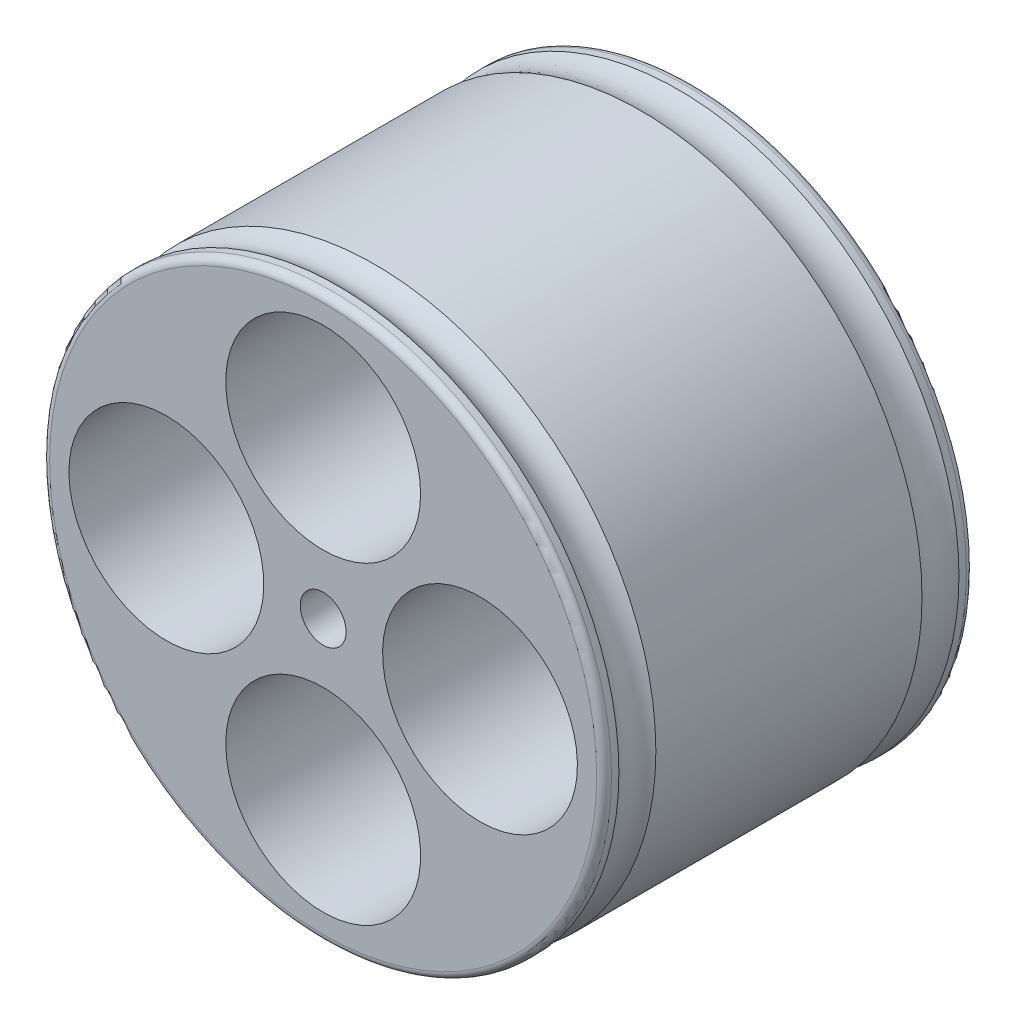
ISO-10303-21;
HEADER;
FILE_DESCRIPTION(('STEP AP214'),'2;1');
FILE_NAME('part.step','',(''),(''),'','','');
FILE_SCHEMA(('AUTOMOTIVE_DESIGN { 1 0 10303 214 1 1 1 1 }'));
ENDSEC;
DATA;
#1=APPLICATION_CONTEXT('core data for automotive mechanical design processes');
#2=APPLICATION_PROTOCOL_DEFINITION('international standard','automotive_design',2000,#1);
#3=PRODUCT_CONTEXT('',#1,'mechanical');
#4=PRODUCT('Part','Part','',(#3));
#5=PRODUCT_RELATED_PRODUCT_CATEGORY('part','',(#4));
#6=PRODUCT_DEFINITION_FORMATION('','',#4);
#7=PRODUCT_DEFINITION_CONTEXT('part definition',#1,'design');
#8=PRODUCT_DEFINITION('design','',#6,#7);
#9=PRODUCT_DEFINITION_SHAPE('','',#8);
#10=(LENGTH_UNIT() NAMED_UNIT(*) SI_UNIT(.MILLI.,.METRE.));
#11=(NAMED_UNIT(*) PLANE_ANGLE_UNIT() SI_UNIT($,.RADIAN.));
#12=(NAMED_UNIT(*) SI_UNIT($,.STERADIAN.) SOLID_ANGLE_UNIT());
#13=UNCERTAINTY_MEASURE_WITH_UNIT(LENGTH_MEASURE(1.E-05),#10,'distance_accuracy_value','');
#14=(GEOMETRIC_REPRESENTATION_CONTEXT(3) GLOBAL_UNCERTAINTY_ASSIGNED_CONTEXT((#13)) GLOBAL_UNIT_ASSIGNED_CONTEXT((#10,
#11,#12)) REPRESENTATION_CONTEXT('',''));
#15=CARTESIAN_POINT('',(0.,0.,0.));
#16=DIRECTION('',(0.,0.,1.));
#17=DIRECTION('',(1.,0.,0.));
#18=AXIS2_PLACEMENT_3D('',#15,#16,#17);
#19=CARTESIAN_POINT('',(0.,0.,25.));
#20=DIRECTION('',(0.,0.,-1.));
#21=DIRECTION('',(-1.,0.,0.));
#22=AXIS2_PLACEMENT_3D('',#19,#20,#21);
#23=CYLINDRICAL_SURFACE('',#22,19.);
#24=CARTESIAN_POINT('',(0.,0.,0.5));
#25=DIRECTION('',(0.,0.,1.));
#26=DIRECTION('',(1.,0.,0.));
#27=AXIS2_PLACEMENT_3D('',#24,#25,#26);
#28=CIRCLE('',#27,19.);
#29=CARTESIAN_POINT('',(19.,0.,0.5));
#30=VERTEX_POINT('',#29);
#31=EDGE_CURVE('E50',#30,#30,#28,.T.);
#32=ORIENTED_EDGE('',*,*,#31,.T.);
#33=EDGE_LOOP('',(#32));
#34=FACE_BOUND('',#33,.T.);
#35=CARTESIAN_POINT('',(0.,0.,1.));
#36=DIRECTION('',(0.,0.,1.));
#37=DIRECTION('',(1.,0.,0.));
#38=AXIS2_PLACEMENT_3D('',#35,#36,#37);
#39=CIRCLE('',#38,19.);
#40=CARTESIAN_POINT('',(19.,0.,1.));
#41=VERTEX_POINT('',#40);
#42=EDGE_CURVE('E59',#41,#41,#39,.T.);
#43=ORIENTED_EDGE('',*,*,#42,.F.);
#44=EDGE_LOOP('',(#43));
#45=FACE_BOUND('',#44,.T.);
#46=ADVANCED_FACE('F35',(#34,#45),#23,.T.);
#47=CARTESIAN_POINT('',(0.,0.,0.));
#48=DIRECTION('',(0.,0.,1.));
#49=DIRECTION('',(1.,0.,0.));
#50=AXIS2_PLACEMENT_3D('',#47,#48,#49);
#51=PLANE('',#50);
#52=CARTESIAN_POINT('',(0.,-10.6064601101063,0.));
#53=DIRECTION('',(0.,0.,1.));
#54=DIRECTION('',(-1.,0.,0.));
#55=AXIS2_PLACEMENT_3D('',#52,#53,#54);
#56=CIRCLE('',#55,6.58897104008716);
#57=CARTESIAN_POINT('',(-6.58897104008716,-10.6064601101063,0.));
#58=VERTEX_POINT('',#57);
#59=EDGE_CURVE('E83',#58,#58,#56,.T.);
#60=ORIENTED_EDGE('',*,*,#59,.T.);
#61=EDGE_LOOP('',(#60));
#62=FACE_BOUND('',#61,.T.);
#63=CARTESIAN_POINT('',(-10.6064601101063,1.1109677263686E-13,0.));
#64=DIRECTION('',(0.,0.,1.));
#65=DIRECTION('',(0.,1.,0.));
#66=AXIS2_PLACEMENT_3D('',#63,#64,#65);
#67=CIRCLE('',#66,6.58897104008716);
#68=CARTESIAN_POINT('',(-10.6064601101062,6.58897104008728,0.));
#69=VERTEX_POINT('',#68);
#70=EDGE_CURVE('E89',#69,#69,#67,.T.);
#71=ORIENTED_EDGE('',*,*,#70,.T.);
#72=EDGE_LOOP('',(#71));
#73=FACE_BOUND('',#72,.T.);
#74=CARTESIAN_POINT('',(10.6064601101063,0.,0.));
#75=DIRECTION('',(0.,0.,1.));
#76=DIRECTION('',(0.,-1.,0.));
#77=AXIS2_PLACEMENT_3D('',#74,#75,#76);
#78=CIRCLE('',#77,6.58897104008716);
#79=CARTESIAN_POINT('',(10.6064601101062,-6.5889710400872,0.));
#80=VERTEX_POINT('',#79);
#81=EDGE_CURVE('E77',#80,#80,#78,.T.);
#82=ORIENTED_EDGE('',*,*,#81,.T.);
#83=EDGE_LOOP('',(#82));
#84=FACE_BOUND('',#83,.T.);
#85=CARTESIAN_POINT('',(0.,10.6064601101063,0.));
#86=DIRECTION('',(0.,0.,1.));
#87=DIRECTION('',(1.,0.,0.));
#88=AXIS2_PLACEMENT_3D('',#85,#86,#87);
#89=CIRCLE('',#88,6.58897104008716);
#90=CARTESIAN_POINT('',(6.58897104008716,10.6064601101063,0.));
#91=VERTEX_POINT('',#90);
#92=EDGE_CURVE('E71',#91,#91,#89,.T.);
#93=ORIENTED_EDGE('',*,*,#92,.T.);
#94=EDGE_LOOP('',(#93));
#95=FACE_BOUND('',#94,.T.);
#96=CARTESIAN_POINT('',(0.,0.,0.));
#97=DIRECTION('',(0.,0.,1.));
#98=DIRECTION('',(1.,0.,0.));
#99=AXIS2_PLACEMENT_3D('',#96,#97,#98);
#100=CIRCLE('',#99,1.55);
#101=CARTESIAN_POINT('',(1.55,0.,0.));
#102=VERTEX_POINT('',#101);
#103=EDGE_CURVE('E63',#102,#102,#100,.T.);
#104=ORIENTED_EDGE('',*,*,#103,.T.);
#105=EDGE_LOOP('',(#104));
#106=FACE_BOUND('',#105,.T.);
#107=CARTESIAN_POINT('',(0.,0.,0.));
#108=DIRECTION('',(0.,0.,1.));
#109=DIRECTION('',(1.,0.,0.));
#110=AXIS2_PLACEMENT_3D('',#107,#108,#109);
#111=CIRCLE('',#110,18.5);
#112=CARTESIAN_POINT('',(18.5,0.,0.));
#113=VERTEX_POINT('',#112);
#114=EDGE_CURVE('E46',#113,#113,#111,.F.);
#115=ORIENTED_EDGE('',*,*,#114,.T.);
#116=EDGE_LOOP('',(#115));
#117=FACE_BOUND('',#116,.T.);
#118=ADVANCED_FACE('F98',(#62,#73,#84,#95,#106,#117),#51,.F.);
#119=CARTESIAN_POINT('',(0.,0.,2.25));
#120=DIRECTION('',(0.,0.,1.));
#121=DIRECTION('',(1.,0.,0.));
#122=AXIS2_PLACEMENT_3D('',#119,#120,#121);
#123=TOROIDAL_SURFACE('',#122,21.4541666666666,2.75416666666663);
#124=ORIENTED_EDGE('',*,*,#42,.T.);
#125=EDGE_LOOP('',(#124));
#126=FACE_BOUND('',#125,.T.);
#127=CARTESIAN_POINT('',(0.,0.,3.5));
#128=DIRECTION('',(0.,0.,1.));
#129=DIRECTION('',(1.,0.,0.));
#130=AXIS2_PLACEMENT_3D('',#127,#128,#129);
#131=CIRCLE('',#130,19.);
#132=CARTESIAN_POINT('',(19.,0.,3.5));
#133=VERTEX_POINT('',#132);
#134=EDGE_CURVE('E55',#133,#133,#131,.T.);
#135=ORIENTED_EDGE('',*,*,#134,.F.);
#136=EDGE_LOOP('',(#135));
#137=FACE_BOUND('',#136,.T.);
#138=ADVANCED_FACE('F144',(#126,#137),#123,.F.);
#139=CARTESIAN_POINT('',(0.,0.,21.5));
#140=DIRECTION('',(0.,0.,1.));
#141=DIRECTION('',(1.,0.,0.));
#142=AXIS2_PLACEMENT_3D('',#139,#140,#141);
#143=CIRCLE('',#142,19.);
#144=CARTESIAN_POINT('',(19.,0.,21.5));
#145=VERTEX_POINT('',#144);
#146=EDGE_CURVE('E60',#145,#145,#143,.T.);
#147=ORIENTED_EDGE('',*,*,#146,.F.);
#148=EDGE_LOOP('',(#147));
#149=FACE_BOUND('',#148,.T.);
#150=ORIENTED_EDGE('',*,*,#134,.T.);
#151=EDGE_LOOP('',(#150));
#152=FACE_BOUND('',#151,.T.);
#153=ADVANCED_FACE('F140',(#149,#152),#23,.T.);
#154=CARTESIAN_POINT('',(0.,0.,22.75));
#155=DIRECTION('',(0.,0.,1.));
#156=DIRECTION('',(1.,0.,0.));
#157=AXIS2_PLACEMENT_3D('',#154,#155,#156);
#158=TOROIDAL_SURFACE('',#157,20.3125,1.8125);
#159=ORIENTED_EDGE('',*,*,#146,.T.);
#160=EDGE_LOOP('',(#159));
#161=FACE_BOUND('',#160,.T.);
#162=CARTESIAN_POINT('',(0.,0.,24.));
#163=DIRECTION('',(0.,0.,1.));
#164=DIRECTION('',(1.,0.,0.));
#165=AXIS2_PLACEMENT_3D('',#162,#163,#164);
#166=CIRCLE('',#165,19.);
#167=CARTESIAN_POINT('',(19.,0.,24.));
#168=VERTEX_POINT('',#167);
#169=EDGE_CURVE('E56',#168,#168,#166,.T.);
#170=ORIENTED_EDGE('',*,*,#169,.F.);
#171=EDGE_LOOP('',(#170));
#172=FACE_BOUND('',#171,.T.);
#173=ADVANCED_FACE('F113',(#161,#172),#158,.F.);
#174=CARTESIAN_POINT('',(0.,0.,25.));
#175=DIRECTION('',(0.,0.,1.));
#176=DIRECTION('',(1.,0.,0.));
#177=AXIS2_PLACEMENT_3D('',#174,#175,#176);
#178=PLANE('',#177);
#179=CARTESIAN_POINT('',(0.,-10.6064601101063,25.));
#180=DIRECTION('',(0.,0.,1.));
#181=DIRECTION('',(-1.,0.,0.));
#182=AXIS2_PLACEMENT_3D('',#179,#180,#181);
#183=CIRCLE('',#182,6.58897104008716);
#184=CARTESIAN_POINT('',(-6.58897104008716,-10.6064601101063,25.));
#185=VERTEX_POINT('',#184);
#186=EDGE_CURVE('E86',#185,#185,#183,.T.);
#187=ORIENTED_EDGE('',*,*,#186,.F.);
#188=EDGE_LOOP('',(#187));
#189=FACE_BOUND('',#188,.T.);
#190=CARTESIAN_POINT('',(-10.6064601101063,1.1109677263686E-13,25.));
#191=DIRECTION('',(0.,0.,1.));
#192=DIRECTION('',(0.,1.,0.));
#193=AXIS2_PLACEMENT_3D('',#190,#191,#192);
#194=CIRCLE('',#193,6.58897104008716);
#195=CARTESIAN_POINT('',(-10.6064601101062,6.58897104008728,25.));
#196=VERTEX_POINT('',#195);
#197=EDGE_CURVE('E92',#196,#196,#194,.T.);
#198=ORIENTED_EDGE('',*,*,#197,.F.);
#199=EDGE_LOOP('',(#198));
#200=FACE_BOUND('',#199,.T.);
#201=CARTESIAN_POINT('',(10.6064601101063,0.,25.));
#202=DIRECTION('',(0.,0.,1.));
#203=DIRECTION('',(0.,-1.,0.));
#204=AXIS2_PLACEMENT_3D('',#201,#202,#203);
#205=CIRCLE('',#204,6.58897104008716);
#206=CARTESIAN_POINT('',(10.6064601101062,-6.5889710400872,25.));
#207=VERTEX_POINT('',#206);
#208=EDGE_CURVE('E80',#207,#207,#205,.T.);
#209=ORIENTED_EDGE('',*,*,#208,.F.);
#210=EDGE_LOOP('',(#209));
#211=FACE_BOUND('',#210,.T.);
#212=CARTESIAN_POINT('',(0.,10.6064601101063,25.));
#213=DIRECTION('',(0.,0.,1.));
#214=DIRECTION('',(1.,0.,0.));
#215=AXIS2_PLACEMENT_3D('',#212,#213,#214);
#216=CIRCLE('',#215,6.58897104008716);
#217=CARTESIAN_POINT('',(6.58897104008716,10.6064601101063,25.));
#218=VERTEX_POINT('',#217);
#219=EDGE_CURVE('E74',#218,#218,#216,.T.);
#220=ORIENTED_EDGE('',*,*,#219,.F.);
#221=EDGE_LOOP('',(#220));
#222=FACE_BOUND('',#221,.T.);
#223=CARTESIAN_POINT('',(0.,0.,25.));
#224=DIRECTION('',(0.,0.,1.));
#225=DIRECTION('',(1.,0.,0.));
#226=AXIS2_PLACEMENT_3D('',#223,#224,#225);
#227=CIRCLE('',#226,1.55);
#228=CARTESIAN_POINT('',(1.55,0.,25.));
#229=VERTEX_POINT('',#228);
#230=EDGE_CURVE('E68',#229,#229,#227,.T.);
#231=ORIENTED_EDGE('',*,*,#230,.F.);
#232=EDGE_LOOP('',(#231));
#233=FACE_BOUND('',#232,.T.);
#234=CARTESIAN_POINT('',(0.,0.,25.));
#235=DIRECTION('',(0.,0.,1.));
#236=DIRECTION('',(1.,0.,0.));
#237=AXIS2_PLACEMENT_3D('',#234,#235,#236);
#238=CIRCLE('',#237,18.5);
#239=CARTESIAN_POINT('',(18.5,0.,25.));
#240=VERTEX_POINT('',#239);
#241=EDGE_CURVE('E42',#240,#240,#238,.T.);
#242=ORIENTED_EDGE('',*,*,#241,.T.);
#243=EDGE_LOOP('',(#242));
#244=FACE_BOUND('',#243,.T.);
#245=ADVANCED_FACE('F109',(#189,#200,#211,#222,#233,#244),#178,.T.);
#246=CARTESIAN_POINT('',(0.,0.,24.5));
#247=DIRECTION('',(0.,0.,1.));
#248=DIRECTION('',(1.,0.,0.));
#249=AXIS2_PLACEMENT_3D('',#246,#247,#248);
#250=CIRCLE('',#249,19.);
#251=CARTESIAN_POINT('',(19.,0.,24.5));
#252=VERTEX_POINT('',#251);
#253=EDGE_CURVE('E10',#252,#252,#250,.F.);
#254=ORIENTED_EDGE('',*,*,#253,.T.);
#255=EDGE_LOOP('',(#254));
#256=FACE_BOUND('',#255,.T.);
#257=ORIENTED_EDGE('',*,*,#169,.T.);
#258=EDGE_LOOP('',(#257));
#259=FACE_BOUND('',#258,.T.);
#260=ADVANCED_FACE('F112',(#256,#259),#23,.T.);
#261=CARTESIAN_POINT('',(0.,0.,0.5));
#262=DIRECTION('',(0.,0.,1.));
#263=DIRECTION('',(1.,0.,0.));
#264=AXIS2_PLACEMENT_3D('',#261,#262,#263);
#265=TOROIDAL_SURFACE('',#264,18.5,0.5);
#266=ORIENTED_EDGE('',*,*,#114,.F.);
#267=EDGE_LOOP('',(#266));
#268=FACE_BOUND('',#267,.T.);
#269=ORIENTED_EDGE('',*,*,#31,.F.);
#270=EDGE_LOOP('',(#269));
#271=FACE_BOUND('',#270,.T.);
#272=ADVANCED_FACE('F133',(#268,#271),#265,.T.);
#273=CARTESIAN_POINT('',(0.,0.,24.5));
#274=DIRECTION('',(0.,0.,1.));
#275=DIRECTION('',(1.,0.,0.));
#276=AXIS2_PLACEMENT_3D('',#273,#274,#275);
#277=TOROIDAL_SURFACE('',#276,18.5,0.5);
#278=ORIENTED_EDGE('',*,*,#253,.F.);
#279=EDGE_LOOP('',(#278));
#280=FACE_BOUND('',#279,.T.);
#281=ORIENTED_EDGE('',*,*,#241,.F.);
#282=EDGE_LOOP('',(#281));
#283=FACE_BOUND('',#282,.T.);
#284=ADVANCED_FACE('F37',(#280,#283),#277,.T.);
#285=CARTESIAN_POINT('',(0.,0.,0.));
#286=DIRECTION('',(0.,0.,1.));
#287=DIRECTION('',(1.,0.,0.));
#288=AXIS2_PLACEMENT_3D('',#285,#286,#287);
#289=CYLINDRICAL_SURFACE('',#288,1.55);
#290=ORIENTED_EDGE('',*,*,#103,.F.);
#291=EDGE_LOOP('',(#290));
#292=FACE_BOUND('',#291,.T.);
#293=ORIENTED_EDGE('',*,*,#230,.T.);
#294=EDGE_LOOP('',(#293));
#295=FACE_BOUND('',#294,.T.);
#296=ADVANCED_FACE('F122',(#292,#295),#289,.F.);
#297=CARTESIAN_POINT('',(0.,10.6064601101063,0.));
#298=DIRECTION('',(0.,0.,1.));
#299=DIRECTION('',(1.,0.,0.));
#300=AXIS2_PLACEMENT_3D('',#297,#298,#299);
#301=CYLINDRICAL_SURFACE('',#300,6.58897104008716);
#302=ORIENTED_EDGE('',*,*,#92,.F.);
#303=EDGE_LOOP('',(#302));
#304=FACE_BOUND('',#303,.T.);
#305=ORIENTED_EDGE('',*,*,#219,.T.);
#306=EDGE_LOOP('',(#305));
#307=FACE_BOUND('',#306,.T.);
#308=ADVANCED_FACE('F124',(#304,#307),#301,.F.);
#309=CARTESIAN_POINT('',(10.6064601101063,0.,0.));
#310=DIRECTION('',(0.,0.,1.));
#311=DIRECTION('',(1.,0.,0.));
#312=AXIS2_PLACEMENT_3D('',#309,#310,#311);
#313=CYLINDRICAL_SURFACE('',#312,6.58897104008716);
#314=ORIENTED_EDGE('',*,*,#81,.F.);
#315=EDGE_LOOP('',(#314));
#316=FACE_BOUND('',#315,.T.);
#317=ORIENTED_EDGE('',*,*,#208,.T.);
#318=EDGE_LOOP('',(#317));
#319=FACE_BOUND('',#318,.T.);
#320=ADVANCED_FACE('F105',(#316,#319),#313,.F.);
#321=CARTESIAN_POINT('',(-10.6064601101063,1.1109677263686E-13,0.));
#322=DIRECTION('',(0.,0.,1.));
#323=DIRECTION('',(1.,0.,0.));
#324=AXIS2_PLACEMENT_3D('',#321,#322,#323);
#325=CYLINDRICAL_SURFACE('',#324,6.58897104008716);
#326=ORIENTED_EDGE('',*,*,#70,.F.);
#327=EDGE_LOOP('',(#326));
#328=FACE_BOUND('',#327,.T.);
#329=ORIENTED_EDGE('',*,*,#197,.T.);
#330=EDGE_LOOP('',(#329));
#331=FACE_BOUND('',#330,.T.);
#332=ADVANCED_FACE('F101',(#328,#331),#325,.F.);
#333=CARTESIAN_POINT('',(0.,-10.6064601101063,0.));
#334=DIRECTION('',(0.,0.,1.));
#335=DIRECTION('',(1.,0.,0.));
#336=AXIS2_PLACEMENT_3D('',#333,#334,#335);
#337=CYLINDRICAL_SURFACE('',#336,6.58897104008716);
#338=ORIENTED_EDGE('',*,*,#59,.F.);
#339=EDGE_LOOP('',(#338));
#340=FACE_BOUND('',#339,.T.);
#341=ORIENTED_EDGE('',*,*,#186,.T.);
#342=EDGE_LOOP('',(#341));
#343=FACE_BOUND('',#342,.T.);
#344=ADVANCED_FACE('F104',(#340,#343),#337,.F.);
#345=CLOSED_SHELL('',(#46,#118,#138,#153,#173,#245,#260,#272,#284,#296,#308,#320,#332,#344));
#346=MANIFOLD_SOLID_BREP('B2',#345);
#347=ADVANCED_BREP_SHAPE_REPRESENTATION('',(#18,#346),#14);
#348=SHAPE_DEFINITION_REPRESENTATION(#9,#347);
ENDSEC;
END-ISO-10303-21;
